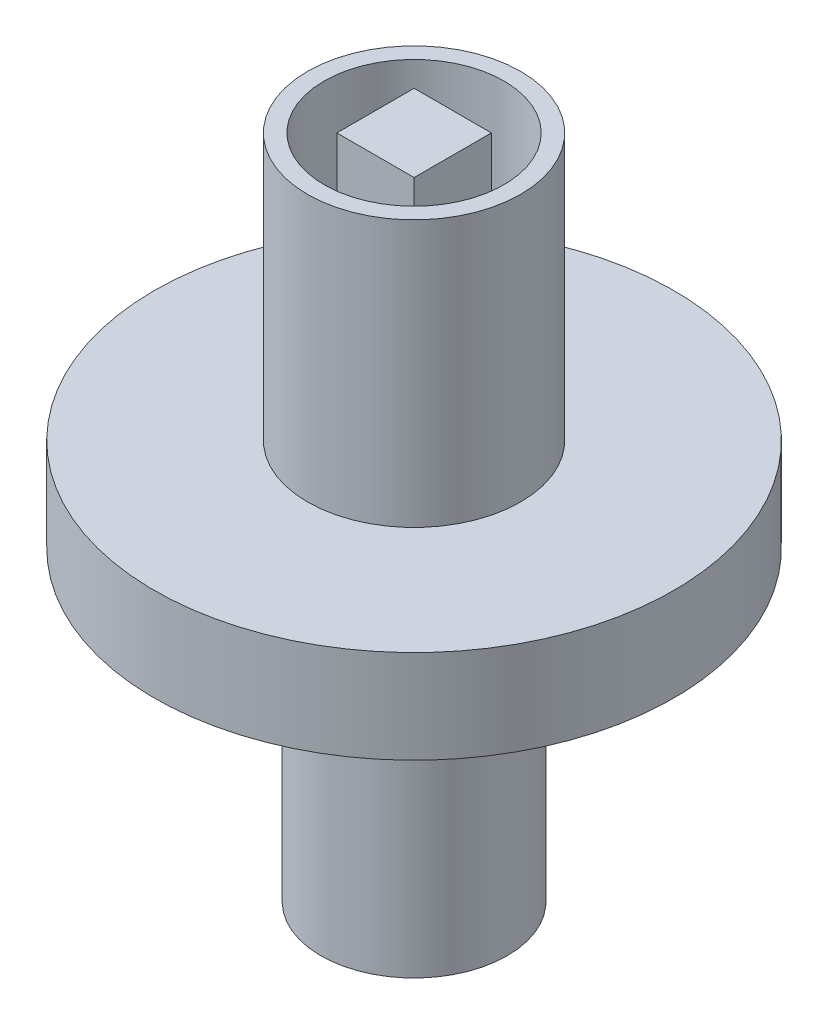
ISO-10303-21;
HEADER;
FILE_DESCRIPTION(('STEP AP214'),'2;1');
FILE_NAME('part.step','',(''),(''),'','','');
FILE_SCHEMA(('AUTOMOTIVE_DESIGN { 1 0 10303 214 1 1 1 1 }'));
ENDSEC;
DATA;
#1=APPLICATION_CONTEXT('core data for automotive mechanical design processes');
#2=APPLICATION_PROTOCOL_DEFINITION('international standard','automotive_design',2000,#1);
#3=PRODUCT_CONTEXT('',#1,'mechanical');
#4=PRODUCT('Part','Part','',(#3));
#5=PRODUCT_RELATED_PRODUCT_CATEGORY('part','',(#4));
#6=PRODUCT_DEFINITION_FORMATION('','',#4);
#7=PRODUCT_DEFINITION_CONTEXT('part definition',#1,'design');
#8=PRODUCT_DEFINITION('design','',#6,#7);
#9=PRODUCT_DEFINITION_SHAPE('','',#8);
#10=(LENGTH_UNIT() NAMED_UNIT(*) SI_UNIT(.MILLI.,.METRE.));
#11=(NAMED_UNIT(*) PLANE_ANGLE_UNIT() SI_UNIT($,.RADIAN.));
#12=(NAMED_UNIT(*) SI_UNIT($,.STERADIAN.) SOLID_ANGLE_UNIT());
#13=UNCERTAINTY_MEASURE_WITH_UNIT(LENGTH_MEASURE(1.E-05),#10,'distance_accuracy_value','');
#14=(GEOMETRIC_REPRESENTATION_CONTEXT(3) GLOBAL_UNCERTAINTY_ASSIGNED_CONTEXT((#13)) GLOBAL_UNIT_ASSIGNED_CONTEXT((#10,
#11,#12)) REPRESENTATION_CONTEXT('',''));
#15=CARTESIAN_POINT('',(0.,0.,0.));
#16=DIRECTION('',(0.,0.,1.));
#17=DIRECTION('',(1.,0.,0.));
#18=AXIS2_PLACEMENT_3D('',#15,#16,#17);
#19=CARTESIAN_POINT('',(0.,-8.,0.));
#20=DIRECTION('',(0.,-1.,0.));
#21=DIRECTION('',(1.,0.,0.));
#22=AXIS2_PLACEMENT_3D('',#19,#20,#21);
#23=CYLINDRICAL_SURFACE('',#22,3.5);
#24=CARTESIAN_POINT('',(0.,-8.,0.));
#25=DIRECTION('',(0.,-1.,0.));
#26=DIRECTION('',(1.,0.,0.));
#27=AXIS2_PLACEMENT_3D('',#24,#25,#26);
#28=CIRCLE('',#27,3.5);
#29=CARTESIAN_POINT('',(-1.49999999999997,-8.00000000000001,3.16227766016838));
#30=VERTEX_POINT('',#29);
#31=CARTESIAN_POINT('',(-3.16227766016835,-8.00000000000001,1.5));
#32=VERTEX_POINT('',#31);
#33=EDGE_CURVE('E191',#30,#32,#28,.T.);
#34=ORIENTED_EDGE('',*,*,#33,.F.);
#35=DIRECTION('',(0.,-1.,0.));
#36=VECTOR('',#35,1.);
#37=CARTESIAN_POINT('',(-1.49999999999997,-8.00000000000001,3.16227766016838));
#38=LINE('',#37,#36);
#39=CARTESIAN_POINT('',(-1.49999999999992,-23.,3.16227766016838));
#40=VERTEX_POINT('',#39);
#41=EDGE_CURVE('E290',#30,#40,#38,.T.);
#42=ORIENTED_EDGE('',*,*,#41,.T.);
#43=CARTESIAN_POINT('',(0.,-23.,0.));
#44=DIRECTION('',(0.,-1.,0.));
#45=DIRECTION('',(1.,0.,0.));
#46=AXIS2_PLACEMENT_3D('',#43,#44,#45);
#47=CIRCLE('',#46,3.5);
#48=CARTESIAN_POINT('',(-3.1622776601683,-23.,1.5));
#49=VERTEX_POINT('',#48);
#50=EDGE_CURVE('E301',#40,#49,#47,.T.);
#51=ORIENTED_EDGE('',*,*,#50,.T.);
#52=DIRECTION('',(0.,-1.,0.));
#53=VECTOR('',#52,1.);
#54=CARTESIAN_POINT('',(-3.16227766016835,-8.00000000000001,1.5));
#55=LINE('',#54,#53);
#56=EDGE_CURVE('E256',#49,#32,#55,.F.);
#57=ORIENTED_EDGE('',*,*,#56,.T.);
#58=EDGE_LOOP('',(#34,#42,#51,#57));
#59=FACE_BOUND('',#58,.T.);
#60=ADVANCED_FACE('F43',(#59),#23,.F.);
#61=CARTESIAN_POINT('',(3.16227766016846,-23.,1.5));
#62=VERTEX_POINT('',#61);
#63=CARTESIAN_POINT('',(1.50000000000008,-23.,3.16227766016838));
#64=VERTEX_POINT('',#63);
#65=EDGE_CURVE('E298',#62,#64,#47,.T.);
#66=ORIENTED_EDGE('',*,*,#65,.T.);
#67=DIRECTION('',(0.,-1.,0.));
#68=VECTOR('',#67,1.);
#69=CARTESIAN_POINT('',(1.50000000000003,-7.99999999999999,3.16227766016838));
#70=LINE('',#69,#68);
#71=CARTESIAN_POINT('',(1.50000000000003,-8.,3.16227766016838));
#72=VERTEX_POINT('',#71);
#73=EDGE_CURVE('E287',#64,#72,#70,.F.);
#74=ORIENTED_EDGE('',*,*,#73,.T.);
#75=CARTESIAN_POINT('',(3.16227766016841,-7.99999999999999,1.5));
#76=VERTEX_POINT('',#75);
#77=EDGE_CURVE('E294',#76,#72,#28,.T.);
#78=ORIENTED_EDGE('',*,*,#77,.F.);
#79=DIRECTION('',(0.,-1.,0.));
#80=VECTOR('',#79,1.);
#81=CARTESIAN_POINT('',(3.16227766016841,-7.99999999999999,1.5));
#82=LINE('',#81,#80);
#83=EDGE_CURVE('E284',#76,#62,#82,.T.);
#84=ORIENTED_EDGE('',*,*,#83,.T.);
#85=EDGE_LOOP('',(#66,#74,#78,#84));
#86=FACE_BOUND('',#85,.T.);
#87=ADVANCED_FACE('F376',(#86),#23,.F.);
#88=CARTESIAN_POINT('',(1.50000000000008,-23.,-3.16227766016838));
#89=VERTEX_POINT('',#88);
#90=CARTESIAN_POINT('',(3.16227766016846,-23.,-1.5));
#91=VERTEX_POINT('',#90);
#92=EDGE_CURVE('E293',#89,#91,#47,.T.);
#93=ORIENTED_EDGE('',*,*,#92,.T.);
#94=DIRECTION('',(0.,-1.,0.));
#95=VECTOR('',#94,1.);
#96=CARTESIAN_POINT('',(3.16227766016841,-7.99999999999999,-1.5));
#97=LINE('',#96,#95);
#98=CARTESIAN_POINT('',(3.16227766016841,-7.99999999999999,-1.5));
#99=VERTEX_POINT('',#98);
#100=EDGE_CURVE('E281',#91,#99,#97,.F.);
#101=ORIENTED_EDGE('',*,*,#100,.T.);
#102=CARTESIAN_POINT('',(1.50000000000003,-7.99999999999999,-3.16227766016838));
#103=VERTEX_POINT('',#102);
#104=EDGE_CURVE('E297',#103,#99,#28,.T.);
#105=ORIENTED_EDGE('',*,*,#104,.F.);
#106=DIRECTION('',(0.,-1.,0.));
#107=VECTOR('',#106,1.);
#108=CARTESIAN_POINT('',(1.50000000000003,-7.99999999999999,-3.16227766016838));
#109=LINE('',#108,#107);
#110=EDGE_CURVE('E278',#103,#89,#109,.T.);
#111=ORIENTED_EDGE('',*,*,#110,.T.);
#112=EDGE_LOOP('',(#93,#101,#105,#111));
#113=FACE_BOUND('',#112,.T.);
#114=ADVANCED_FACE('F371',(#113),#23,.F.);
#115=CARTESIAN_POINT('',(0.,12.,0.));
#116=DIRECTION('',(0.,1.,0.));
#117=DIRECTION('',(-1.,0.,0.));
#118=AXIS2_PLACEMENT_3D('',#115,#116,#117);
#119=PLANE('',#118);
#120=CARTESIAN_POINT('',(0.,12.,0.));
#121=DIRECTION('',(0.,1.,0.));
#122=DIRECTION('',(-1.,0.,0.));
#123=AXIS2_PLACEMENT_3D('',#120,#121,#122);
#124=CIRCLE('',#123,6.75);
#125=CARTESIAN_POINT('',(-6.75000000000004,12.,0.));
#126=VERTEX_POINT('',#125);
#127=EDGE_CURVE('E340',#126,#126,#124,.T.);
#128=ORIENTED_EDGE('',*,*,#127,.T.);
#129=EDGE_LOOP('',(#128));
#130=FACE_BOUND('',#129,.T.);
#131=DIRECTION('',(1.,0.,0.));
#132=VECTOR('',#131,1.);
#133=CARTESIAN_POINT('',(-2.89523813184805,12.,2.90262546082187));
#134=LINE('',#133,#132);
#135=CARTESIAN_POINT('',(-2.89523813184805,12.,2.90262546082187));
#136=VERTEX_POINT('',#135);
#137=CARTESIAN_POINT('',(2.90476186815195,12.,2.90262546082187));
#138=VERTEX_POINT('',#137);
#139=EDGE_CURVE('E321',#136,#138,#134,.T.);
#140=ORIENTED_EDGE('',*,*,#139,.F.);
#141=DIRECTION('',(0.,0.,1.));
#142=VECTOR('',#141,1.);
#143=CARTESIAN_POINT('',(-2.89523813184805,12.,-2.89737453917813));
#144=LINE('',#143,#142);
#145=CARTESIAN_POINT('',(-2.89523813184805,12.,-2.89737453917813));
#146=VERTEX_POINT('',#145);
#147=EDGE_CURVE('E303',#146,#136,#144,.T.);
#148=ORIENTED_EDGE('',*,*,#147,.F.);
#149=DIRECTION('',(-1.,0.,0.));
#150=VECTOR('',#149,1.);
#151=CARTESIAN_POINT('',(-2.89523813184805,12.,-2.89737453917813));
#152=LINE('',#151,#150);
#153=CARTESIAN_POINT('',(2.90476186815195,12.,-2.89737453917813));
#154=VERTEX_POINT('',#153);
#155=EDGE_CURVE('E310',#154,#146,#152,.T.);
#156=ORIENTED_EDGE('',*,*,#155,.F.);
#157=DIRECTION('',(0.,0.,-1.));
#158=VECTOR('',#157,1.);
#159=CARTESIAN_POINT('',(2.90476186815195,12.,-2.89737453917813));
#160=LINE('',#159,#158);
#161=EDGE_CURVE('E323',#138,#154,#160,.T.);
#162=ORIENTED_EDGE('',*,*,#161,.F.);
#163=EDGE_LOOP('',(#140,#148,#156,#162));
#164=FACE_BOUND('',#163,.T.);
#165=ADVANCED_FACE('F363',(#130,#164),#119,.T.);
#166=CARTESIAN_POINT('',(0.,0.,0.));
#167=DIRECTION('',(0.,1.,0.));
#168=DIRECTION('',(-1.,0.,0.));
#169=AXIS2_PLACEMENT_3D('',#166,#167,#168);
#170=PLANE('',#169);
#171=CARTESIAN_POINT('',(0.,0.,0.));
#172=DIRECTION('',(0.,-1.,0.));
#173=DIRECTION('',(1.,0.,0.));
#174=AXIS2_PLACEMENT_3D('',#171,#172,#173);
#175=CIRCLE('',#174,7.);
#176=CARTESIAN_POINT('',(7.,0.,0.));
#177=VERTEX_POINT('',#176);
#178=EDGE_CURVE('E11',#177,#177,#175,.T.);
#179=ORIENTED_EDGE('',*,*,#178,.F.);
#180=EDGE_LOOP('',(#179));
#181=FACE_BOUND('',#180,.T.);
#182=CARTESIAN_POINT('',(3.30263446518398E-13,0.,0.));
#183=DIRECTION('',(0.,1.,0.));
#184=DIRECTION('',(-1.,0.,0.));
#185=AXIS2_PLACEMENT_3D('',#182,#183,#184);
#186=CIRCLE('',#185,19.4999999999997);
#187=CARTESIAN_POINT('',(-19.4999999999993,-1.36278794517344E-13,0.));
#188=VERTEX_POINT('',#187);
#189=EDGE_CURVE('E47',#188,#188,#186,.T.);
#190=ORIENTED_EDGE('',*,*,#189,.F.);
#191=EDGE_LOOP('',(#190));
#192=FACE_BOUND('',#191,.T.);
#193=ADVANCED_FACE('F45',(#181,#192),#170,.F.);
#194=CARTESIAN_POINT('',(0.,96.2797297297297,0.));
#195=DIRECTION('',(0.,1.,0.));
#196=DIRECTION('',(-1.,0.,0.));
#197=AXIS2_PLACEMENT_3D('',#194,#195,#196);
#198=CYLINDRICAL_SURFACE('',#197,19.4999999999997);
#199=CARTESIAN_POINT('',(3.06251703526197E-13,6.99999999999994,0.));
#200=DIRECTION('',(0.,1.,0.));
#201=DIRECTION('',(-1.,0.,0.));
#202=AXIS2_PLACEMENT_3D('',#199,#200,#201);
#203=CIRCLE('',#202,19.4999999999997);
#204=CARTESIAN_POINT('',(-19.4999999999994,6.99999999999987,0.));
#205=VERTEX_POINT('',#204);
#206=EDGE_CURVE('E352',#205,#205,#203,.T.);
#207=ORIENTED_EDGE('',*,*,#206,.F.);
#208=EDGE_LOOP('',(#207));
#209=FACE_BOUND('',#208,.T.);
#210=ORIENTED_EDGE('',*,*,#189,.T.);
#211=EDGE_LOOP('',(#210));
#212=FACE_BOUND('',#211,.T.);
#213=ADVANCED_FACE('F360',(#209,#212),#198,.T.);
#214=CARTESIAN_POINT('',(19.5,7.00000000000002,0.));
#215=DIRECTION('',(0.,-1.,0.));
#216=DIRECTION('',(1.,0.,0.));
#217=AXIS2_PLACEMENT_3D('',#214,#215,#216);
#218=PLANE('',#217);
#219=CARTESIAN_POINT('',(3.06251703526197E-13,6.99999999999998,0.));
#220=DIRECTION('',(0.,1.,0.));
#221=DIRECTION('',(-1.,0.,0.));
#222=AXIS2_PLACEMENT_3D('',#219,#220,#221);
#223=CIRCLE('',#222,7.99999999999969);
#224=CARTESIAN_POINT('',(-7.99999999999939,6.99999999999995,0.));
#225=VERTEX_POINT('',#224);
#226=EDGE_CURVE('E350',#225,#225,#223,.T.);
#227=ORIENTED_EDGE('',*,*,#226,.F.);
#228=EDGE_LOOP('',(#227));
#229=FACE_BOUND('',#228,.T.);
#230=ORIENTED_EDGE('',*,*,#206,.T.);
#231=EDGE_LOOP('',(#230));
#232=FACE_BOUND('',#231,.T.);
#233=ADVANCED_FACE('F369',(#229,#232),#218,.F.);
#234=CARTESIAN_POINT('',(0.,96.2797297297297,0.));
#235=DIRECTION('',(0.,1.,0.));
#236=DIRECTION('',(-1.,0.,0.));
#237=AXIS2_PLACEMENT_3D('',#234,#235,#236);
#238=CYLINDRICAL_SURFACE('',#237,7.99999999999973);
#239=CARTESIAN_POINT('',(2.37646723548482E-13,27.,0.));
#240=DIRECTION('',(0.,1.,0.));
#241=DIRECTION('',(-1.,0.,0.));
#242=AXIS2_PLACEMENT_3D('',#239,#240,#241);
#243=CIRCLE('',#242,7.99999999999976);
#244=CARTESIAN_POINT('',(-7.99999999999952,26.9999999999999,0.));
#245=VERTEX_POINT('',#244);
#246=EDGE_CURVE('E343',#245,#245,#243,.T.);
#247=ORIENTED_EDGE('',*,*,#246,.F.);
#248=EDGE_LOOP('',(#247));
#249=FACE_BOUND('',#248,.T.);
#250=ORIENTED_EDGE('',*,*,#226,.T.);
#251=EDGE_LOOP('',(#250));
#252=FACE_BOUND('',#251,.T.);
#253=ADVANCED_FACE('F636',(#249,#252),#238,.T.);
#254=CARTESIAN_POINT('',(8.,27.,0.));
#255=DIRECTION('',(0.,-1.,0.));
#256=DIRECTION('',(1.,0.,0.));
#257=AXIS2_PLACEMENT_3D('',#254,#255,#256);
#258=PLANE('',#257);
#259=CARTESIAN_POINT('',(0.,27.,0.));
#260=DIRECTION('',(0.,1.,0.));
#261=DIRECTION('',(-1.,0.,0.));
#262=AXIS2_PLACEMENT_3D('',#259,#260,#261);
#263=CIRCLE('',#262,6.75);
#264=CARTESIAN_POINT('',(-6.75000000000009,27.,0.));
#265=VERTEX_POINT('',#264);
#266=EDGE_CURVE('E339',#265,#265,#263,.T.);
#267=ORIENTED_EDGE('',*,*,#266,.F.);
#268=EDGE_LOOP('',(#267));
#269=FACE_BOUND('',#268,.T.);
#270=ORIENTED_EDGE('',*,*,#246,.T.);
#271=EDGE_LOOP('',(#270));
#272=FACE_BOUND('',#271,.T.);
#273=ADVANCED_FACE('F627',(#269,#272),#258,.F.);
#274=CARTESIAN_POINT('',(0.,12.,0.));
#275=DIRECTION('',(0.,1.,0.));
#276=DIRECTION('',(-1.,0.,0.));
#277=AXIS2_PLACEMENT_3D('',#274,#275,#276);
#278=CYLINDRICAL_SURFACE('',#277,6.75);
#279=ORIENTED_EDGE('',*,*,#127,.F.);
#280=EDGE_LOOP('',(#279));
#281=FACE_BOUND('',#280,.T.);
#282=ORIENTED_EDGE('',*,*,#266,.T.);
#283=EDGE_LOOP('',(#282));
#284=FACE_BOUND('',#283,.T.);
#285=ADVANCED_FACE('F617',(#281,#284),#278,.F.);
#286=CARTESIAN_POINT('',(-2.8952381318481,27.,-2.89737453917813));
#287=DIRECTION('',(1.,0.,0.));
#288=DIRECTION('',(0.,1.,0.));
#289=AXIS2_PLACEMENT_3D('',#286,#287,#288);
#290=PLANE('',#289);
#291=ORIENTED_EDGE('',*,*,#147,.T.);
#292=DIRECTION('',(0.,-1.,0.));
#293=VECTOR('',#292,1.);
#294=CARTESIAN_POINT('',(-2.8952381318481,27.,2.90262546082187));
#295=LINE('',#294,#293);
#296=CARTESIAN_POINT('',(-2.8952381318481,27.,2.90262546082187));
#297=VERTEX_POINT('',#296);
#298=EDGE_CURVE('E336',#297,#136,#295,.T.);
#299=ORIENTED_EDGE('',*,*,#298,.F.);
#300=DIRECTION('',(0.,0.,1.));
#301=VECTOR('',#300,1.);
#302=CARTESIAN_POINT('',(-2.8952381318481,27.,-2.89737453917813));
#303=LINE('',#302,#301);
#304=CARTESIAN_POINT('',(-2.8952381318481,27.,-2.89737453917813));
#305=VERTEX_POINT('',#304);
#306=EDGE_CURVE('E305',#305,#297,#303,.T.);
#307=ORIENTED_EDGE('',*,*,#306,.F.);
#308=DIRECTION('',(0.,-1.,0.));
#309=VECTOR('',#308,1.);
#310=CARTESIAN_POINT('',(-2.8952381318481,27.,-2.89737453917813));
#311=LINE('',#310,#309);
#312=EDGE_CURVE('E318',#305,#146,#311,.T.);
#313=ORIENTED_EDGE('',*,*,#312,.T.);
#314=EDGE_LOOP('',(#291,#299,#307,#313));
#315=FACE_BOUND('',#314,.T.);
#316=ADVANCED_FACE('F608',(#315),#290,.F.);
#317=CARTESIAN_POINT('',(-2.8952381318481,27.,2.90262546082187));
#318=DIRECTION('',(0.,0.,-1.));
#319=DIRECTION('',(-1.,0.,0.));
#320=AXIS2_PLACEMENT_3D('',#317,#318,#319);
#321=PLANE('',#320);
#322=ORIENTED_EDGE('',*,*,#139,.T.);
#323=DIRECTION('',(0.,-1.,0.));
#324=VECTOR('',#323,1.);
#325=CARTESIAN_POINT('',(2.9047618681519,27.,2.90262546082187));
#326=LINE('',#325,#324);
#327=CARTESIAN_POINT('',(2.9047618681519,27.,2.90262546082187));
#328=VERTEX_POINT('',#327);
#329=EDGE_CURVE('E332',#328,#138,#326,.T.);
#330=ORIENTED_EDGE('',*,*,#329,.F.);
#331=DIRECTION('',(1.,0.,0.));
#332=VECTOR('',#331,1.);
#333=CARTESIAN_POINT('',(-2.8952381318481,27.,2.90262546082187));
#334=LINE('',#333,#332);
#335=EDGE_CURVE('E309',#297,#328,#334,.T.);
#336=ORIENTED_EDGE('',*,*,#335,.F.);
#337=ORIENTED_EDGE('',*,*,#298,.T.);
#338=EDGE_LOOP('',(#322,#330,#336,#337));
#339=FACE_BOUND('',#338,.T.);
#340=ADVANCED_FACE('F599',(#339),#321,.F.);
#341=CARTESIAN_POINT('',(2.9047618681519,27.,-2.89737453917813));
#342=DIRECTION('',(-1.,0.,0.));
#343=DIRECTION('',(0.,-1.,0.));
#344=AXIS2_PLACEMENT_3D('',#341,#342,#343);
#345=PLANE('',#344);
#346=ORIENTED_EDGE('',*,*,#161,.T.);
#347=DIRECTION('',(0.,-1.,0.));
#348=VECTOR('',#347,1.);
#349=CARTESIAN_POINT('',(2.9047618681519,27.,-2.89737453917813));
#350=LINE('',#349,#348);
#351=CARTESIAN_POINT('',(2.9047618681519,27.,-2.89737453917813));
#352=VERTEX_POINT('',#351);
#353=EDGE_CURVE('E330',#352,#154,#350,.T.);
#354=ORIENTED_EDGE('',*,*,#353,.F.);
#355=DIRECTION('',(0.,0.,-1.));
#356=VECTOR('',#355,1.);
#357=CARTESIAN_POINT('',(2.9047618681519,27.,-2.89737453917813));
#358=LINE('',#357,#356);
#359=EDGE_CURVE('E313',#328,#352,#358,.T.);
#360=ORIENTED_EDGE('',*,*,#359,.F.);
#361=ORIENTED_EDGE('',*,*,#329,.T.);
#362=EDGE_LOOP('',(#346,#354,#360,#361));
#363=FACE_BOUND('',#362,.T.);
#364=ADVANCED_FACE('F591',(#363),#345,.F.);
#365=CARTESIAN_POINT('',(-2.8952381318481,27.,-2.89737453917813));
#366=DIRECTION('',(0.,0.,1.));
#367=DIRECTION('',(1.,0.,0.));
#368=AXIS2_PLACEMENT_3D('',#365,#366,#367);
#369=PLANE('',#368);
#370=ORIENTED_EDGE('',*,*,#155,.T.);
#371=ORIENTED_EDGE('',*,*,#312,.F.);
#372=DIRECTION('',(-1.,0.,0.));
#373=VECTOR('',#372,1.);
#374=CARTESIAN_POINT('',(-2.8952381318481,27.,-2.89737453917813));
#375=LINE('',#374,#373);
#376=EDGE_CURVE('E316',#352,#305,#375,.T.);
#377=ORIENTED_EDGE('',*,*,#376,.F.);
#378=ORIENTED_EDGE('',*,*,#353,.T.);
#379=EDGE_LOOP('',(#370,#371,#377,#378));
#380=FACE_BOUND('',#379,.T.);
#381=ADVANCED_FACE('F583',(#380),#369,.F.);
#382=CARTESIAN_POINT('',(0.,27.,0.));
#383=DIRECTION('',(0.,1.,0.));
#384=DIRECTION('',(-1.,0.,0.));
#385=AXIS2_PLACEMENT_3D('',#382,#383,#384);
#386=PLANE('',#385);
#387=ORIENTED_EDGE('',*,*,#306,.T.);
#388=ORIENTED_EDGE('',*,*,#335,.T.);
#389=ORIENTED_EDGE('',*,*,#359,.T.);
#390=ORIENTED_EDGE('',*,*,#376,.T.);
#391=EDGE_LOOP('',(#387,#388,#389,#390));
#392=FACE_BOUND('',#391,.T.);
#393=ADVANCED_FACE('F576',(#392),#386,.T.);
#394=CARTESIAN_POINT('',(0.,-23.,0.));
#395=DIRECTION('',(0.,1.,0.));
#396=DIRECTION('',(-1.,0.,0.));
#397=AXIS2_PLACEMENT_3D('',#394,#395,#396);
#398=CYLINDRICAL_SURFACE('',#397,7.);
#399=CARTESIAN_POINT('',(0.,-23.,0.));
#400=DIRECTION('',(0.,-1.,0.));
#401=DIRECTION('',(1.,0.,0.));
#402=AXIS2_PLACEMENT_3D('',#399,#400,#401);
#403=CIRCLE('',#402,7.);
#404=CARTESIAN_POINT('',(7.00000000000008,-23.,0.));
#405=VERTEX_POINT('',#404);
#406=EDGE_CURVE('E296',#405,#405,#403,.T.);
#407=ORIENTED_EDGE('',*,*,#406,.F.);
#408=EDGE_LOOP('',(#407));
#409=FACE_BOUND('',#408,.T.);
#410=ORIENTED_EDGE('',*,*,#178,.T.);
#411=EDGE_LOOP('',(#410));
#412=FACE_BOUND('',#411,.T.);
#413=ADVANCED_FACE('F393',(#409,#412),#398,.T.);
#414=CARTESIAN_POINT('',(0.,-23.,0.));
#415=DIRECTION('',(0.,-1.,0.));
#416=DIRECTION('',(1.,0.,0.));
#417=AXIS2_PLACEMENT_3D('',#414,#415,#416);
#418=PLANE('',#417);
#419=DIRECTION('',(0.,0.,-1.));
#420=VECTOR('',#419,1.);
#421=CARTESIAN_POINT('',(-1.49999999999992,-23.,1.5));
#422=LINE('',#421,#420);
#423=CARTESIAN_POINT('',(-1.49999999999992,-23.,5.3));
#424=VERTEX_POINT('',#423);
#425=EDGE_CURVE('E228',#424,#40,#422,.T.);
#426=ORIENTED_EDGE('',*,*,#425,.F.);
#427=DIRECTION('',(-1.,0.,0.));
#428=VECTOR('',#427,1.);
#429=CARTESIAN_POINT('',(-1.49999999999992,-23.,5.3));
#430=LINE('',#429,#428);
#431=CARTESIAN_POINT('',(1.50000000000008,-23.,5.3));
#432=VERTEX_POINT('',#431);
#433=EDGE_CURVE('E251',#432,#424,#430,.T.);
#434=ORIENTED_EDGE('',*,*,#433,.F.);
#435=DIRECTION('',(0.,0.,1.));
#436=VECTOR('',#435,1.);
#437=CARTESIAN_POINT('',(1.50000000000008,-23.,1.5));
#438=LINE('',#437,#436);
#439=EDGE_CURVE('E249',#64,#432,#438,.T.);
#440=ORIENTED_EDGE('',*,*,#439,.F.);
#441=ORIENTED_EDGE('',*,*,#65,.F.);
#442=DIRECTION('',(-1.,0.,0.));
#443=VECTOR('',#442,1.);
#444=CARTESIAN_POINT('',(1.50000000000008,-23.,1.5));
#445=LINE('',#444,#443);
#446=CARTESIAN_POINT('',(5.30000000000008,-23.,1.5));
#447=VERTEX_POINT('',#446);
#448=EDGE_CURVE('E247',#447,#62,#445,.T.);
#449=ORIENTED_EDGE('',*,*,#448,.F.);
#450=DIRECTION('',(0.,0.,1.));
#451=VECTOR('',#450,1.);
#452=CARTESIAN_POINT('',(5.30000000000008,-23.,1.5));
#453=LINE('',#452,#451);
#454=CARTESIAN_POINT('',(5.30000000000008,-23.,-1.5));
#455=VERTEX_POINT('',#454);
#456=EDGE_CURVE('E244',#455,#447,#453,.T.);
#457=ORIENTED_EDGE('',*,*,#456,.F.);
#458=DIRECTION('',(1.,0.,0.));
#459=VECTOR('',#458,1.);
#460=CARTESIAN_POINT('',(1.50000000000008,-23.,-1.5));
#461=LINE('',#460,#459);
#462=EDGE_CURVE('E242',#91,#455,#461,.T.);
#463=ORIENTED_EDGE('',*,*,#462,.F.);
#464=ORIENTED_EDGE('',*,*,#92,.F.);
#465=DIRECTION('',(0.,0.,1.));
#466=VECTOR('',#465,1.);
#467=CARTESIAN_POINT('',(1.50000000000008,-23.,-5.3));
#468=LINE('',#467,#466);
#469=CARTESIAN_POINT('',(1.50000000000008,-23.,-5.3));
#470=VERTEX_POINT('',#469);
#471=EDGE_CURVE('E240',#470,#89,#468,.T.);
#472=ORIENTED_EDGE('',*,*,#471,.F.);
#473=DIRECTION('',(1.,0.,0.));
#474=VECTOR('',#473,1.);
#475=CARTESIAN_POINT('',(-1.49999999999992,-23.,-5.3));
#476=LINE('',#475,#474);
#477=CARTESIAN_POINT('',(-1.49999999999992,-23.,-5.3));
#478=VERTEX_POINT('',#477);
#479=EDGE_CURVE('E237',#478,#470,#476,.T.);
#480=ORIENTED_EDGE('',*,*,#479,.F.);
#481=DIRECTION('',(0.,0.,-1.));
#482=VECTOR('',#481,1.);
#483=CARTESIAN_POINT('',(-1.49999999999992,-23.,-5.3));
#484=LINE('',#483,#482);
#485=CARTESIAN_POINT('',(-1.49999999999992,-23.,-3.16227766016838));
#486=VERTEX_POINT('',#485);
#487=EDGE_CURVE('E235',#486,#478,#484,.T.);
#488=ORIENTED_EDGE('',*,*,#487,.F.);
#489=CARTESIAN_POINT('',(-3.1622776601683,-23.,-1.5));
#490=VERTEX_POINT('',#489);
#491=EDGE_CURVE('E405',#490,#486,#47,.T.);
#492=ORIENTED_EDGE('',*,*,#491,.F.);
#493=DIRECTION('',(1.,0.,0.));
#494=VECTOR('',#493,1.);
#495=CARTESIAN_POINT('',(-5.29999999999992,-23.,-1.5));
#496=LINE('',#495,#494);
#497=CARTESIAN_POINT('',(-5.29999999999992,-23.,-1.5));
#498=VERTEX_POINT('',#497);
#499=EDGE_CURVE('E233',#498,#490,#496,.T.);
#500=ORIENTED_EDGE('',*,*,#499,.F.);
#501=DIRECTION('',(0.,0.,-1.));
#502=VECTOR('',#501,1.);
#503=CARTESIAN_POINT('',(-5.29999999999992,-23.,1.5));
#504=LINE('',#503,#502);
#505=CARTESIAN_POINT('',(-5.29999999999992,-23.,1.5));
#506=VERTEX_POINT('',#505);
#507=EDGE_CURVE('E231',#506,#498,#504,.T.);
#508=ORIENTED_EDGE('',*,*,#507,.F.);
#509=DIRECTION('',(-1.,0.,0.));
#510=VECTOR('',#509,1.);
#511=CARTESIAN_POINT('',(-5.29999999999992,-23.,1.5));
#512=LINE('',#511,#510);
#513=EDGE_CURVE('E200',#49,#506,#512,.T.);
#514=ORIENTED_EDGE('',*,*,#513,.F.);
#515=ORIENTED_EDGE('',*,*,#50,.F.);
#516=EDGE_LOOP('',(#426,#434,#440,#441,#449,#457,#463,#464,#472,#480,#488,#492,#500,#508,#514,#515));
#517=FACE_BOUND('',#516,.T.);
#518=ORIENTED_EDGE('',*,*,#406,.T.);
#519=EDGE_LOOP('',(#518));
#520=FACE_BOUND('',#519,.T.);
#521=ADVANCED_FACE('F387',(#517,#520),#418,.T.);
#522=ORIENTED_EDGE('',*,*,#491,.T.);
#523=DIRECTION('',(0.,-1.,0.));
#524=VECTOR('',#523,1.);
#525=CARTESIAN_POINT('',(-1.49999999999997,-8.00000000000001,-3.16227766016838));
#526=LINE('',#525,#524);
#527=CARTESIAN_POINT('',(-1.49999999999997,-8.,-3.16227766016838));
#528=VERTEX_POINT('',#527);
#529=EDGE_CURVE('E275',#486,#528,#526,.F.);
#530=ORIENTED_EDGE('',*,*,#529,.T.);
#531=CARTESIAN_POINT('',(-3.16227766016835,-8.00000000000001,-1.5));
#532=VERTEX_POINT('',#531);
#533=EDGE_CURVE('E418',#532,#528,#28,.T.);
#534=ORIENTED_EDGE('',*,*,#533,.F.);
#535=DIRECTION('',(0.,-1.,0.));
#536=VECTOR('',#535,1.);
#537=CARTESIAN_POINT('',(-3.16227766016835,-8.00000000000001,-1.5));
#538=LINE('',#537,#536);
#539=EDGE_CURVE('E272',#532,#490,#538,.T.);
#540=ORIENTED_EDGE('',*,*,#539,.T.);
#541=EDGE_LOOP('',(#522,#530,#534,#540));
#542=FACE_BOUND('',#541,.T.);
#543=ADVANCED_FACE('F379',(#542),#23,.F.);
#544=CARTESIAN_POINT('',(0.,-8.,0.));
#545=DIRECTION('',(0.,-1.,0.));
#546=DIRECTION('',(1.,0.,0.));
#547=AXIS2_PLACEMENT_3D('',#544,#545,#546);
#548=PLANE('',#547);
#549=ORIENTED_EDGE('',*,*,#77,.T.);
#550=DIRECTION('',(0.,0.,1.));
#551=VECTOR('',#550,1.);
#552=CARTESIAN_POINT('',(1.50000000000003,-8.,1.5));
#553=LINE('',#552,#551);
#554=CARTESIAN_POINT('',(1.50000000000003,-8.,5.3));
#555=VERTEX_POINT('',#554);
#556=EDGE_CURVE('E224',#72,#555,#553,.T.);
#557=ORIENTED_EDGE('',*,*,#556,.T.);
#558=DIRECTION('',(-1.,0.,0.));
#559=VECTOR('',#558,1.);
#560=CARTESIAN_POINT('',(-1.49999999999997,-8.,5.3));
#561=LINE('',#560,#559);
#562=CARTESIAN_POINT('',(-1.49999999999997,-8.,5.3));
#563=VERTEX_POINT('',#562);
#564=EDGE_CURVE('E205',#555,#563,#561,.T.);
#565=ORIENTED_EDGE('',*,*,#564,.T.);
#566=DIRECTION('',(0.,0.,-1.));
#567=VECTOR('',#566,1.);
#568=CARTESIAN_POINT('',(-1.49999999999997,-8.,1.5));
#569=LINE('',#568,#567);
#570=EDGE_CURVE('E194',#563,#30,#569,.T.);
#571=ORIENTED_EDGE('',*,*,#570,.T.);
#572=ORIENTED_EDGE('',*,*,#33,.T.);
#573=DIRECTION('',(-1.,0.,0.));
#574=VECTOR('',#573,1.);
#575=CARTESIAN_POINT('',(-5.29999999999997,-8.00000000000002,1.5));
#576=LINE('',#575,#574);
#577=CARTESIAN_POINT('',(-5.29999999999997,-8.00000000000002,1.5));
#578=VERTEX_POINT('',#577);
#579=EDGE_CURVE('E184',#32,#578,#576,.T.);
#580=ORIENTED_EDGE('',*,*,#579,.T.);
#581=DIRECTION('',(0.,0.,-1.));
#582=VECTOR('',#581,1.);
#583=CARTESIAN_POINT('',(-5.29999999999997,-8.00000000000002,1.5));
#584=LINE('',#583,#582);
#585=CARTESIAN_POINT('',(-5.29999999999997,-8.00000000000002,-1.5));
#586=VERTEX_POINT('',#585);
#587=EDGE_CURVE('E189',#578,#586,#584,.T.);
#588=ORIENTED_EDGE('',*,*,#587,.T.);
#589=DIRECTION('',(1.,0.,0.));
#590=VECTOR('',#589,1.);
#591=CARTESIAN_POINT('',(-5.29999999999997,-8.00000000000002,-1.5));
#592=LINE('',#591,#590);
#593=EDGE_CURVE('E66',#586,#532,#592,.T.);
#594=ORIENTED_EDGE('',*,*,#593,.T.);
#595=ORIENTED_EDGE('',*,*,#533,.T.);
#596=DIRECTION('',(0.,0.,-1.));
#597=VECTOR('',#596,1.);
#598=CARTESIAN_POINT('',(-1.49999999999997,-8.,-5.3));
#599=LINE('',#598,#597);
#600=CARTESIAN_POINT('',(-1.49999999999997,-8.,-5.3));
#601=VERTEX_POINT('',#600);
#602=EDGE_CURVE('E209',#528,#601,#599,.T.);
#603=ORIENTED_EDGE('',*,*,#602,.T.);
#604=DIRECTION('',(1.,0.,0.));
#605=VECTOR('',#604,1.);
#606=CARTESIAN_POINT('',(-1.49999999999997,-8.,-5.3));
#607=LINE('',#606,#605);
#608=CARTESIAN_POINT('',(1.50000000000003,-8.,-5.3));
#609=VERTEX_POINT('',#608);
#610=EDGE_CURVE('E214',#601,#609,#607,.T.);
#611=ORIENTED_EDGE('',*,*,#610,.T.);
#612=DIRECTION('',(0.,0.,1.));
#613=VECTOR('',#612,1.);
#614=CARTESIAN_POINT('',(1.50000000000003,-8.,-5.3));
#615=LINE('',#614,#613);
#616=EDGE_CURVE('E59',#609,#103,#615,.T.);
#617=ORIENTED_EDGE('',*,*,#616,.T.);
#618=ORIENTED_EDGE('',*,*,#104,.T.);
#619=DIRECTION('',(1.,0.,0.));
#620=VECTOR('',#619,1.);
#621=CARTESIAN_POINT('',(1.50000000000003,-8.,-1.5));
#622=LINE('',#621,#620);
#623=CARTESIAN_POINT('',(5.30000000000003,-7.99999999999998,-1.5));
#624=VERTEX_POINT('',#623);
#625=EDGE_CURVE('E217',#99,#624,#622,.T.);
#626=ORIENTED_EDGE('',*,*,#625,.T.);
#627=DIRECTION('',(0.,0.,1.));
#628=VECTOR('',#627,1.);
#629=CARTESIAN_POINT('',(5.30000000000003,-7.99999999999998,1.5));
#630=LINE('',#629,#628);
#631=CARTESIAN_POINT('',(5.30000000000003,-7.99999999999998,1.5));
#632=VERTEX_POINT('',#631);
#633=EDGE_CURVE('E219',#624,#632,#630,.T.);
#634=ORIENTED_EDGE('',*,*,#633,.T.);
#635=DIRECTION('',(-1.,0.,0.));
#636=VECTOR('',#635,1.);
#637=CARTESIAN_POINT('',(1.50000000000003,-8.,1.5));
#638=LINE('',#637,#636);
#639=EDGE_CURVE('E222',#632,#76,#638,.T.);
#640=ORIENTED_EDGE('',*,*,#639,.T.);
#641=EDGE_LOOP('',(#549,#557,#565,#571,#572,#580,#588,#594,#595,#603,#611,#617,#618,#626,#634,#640));
#642=FACE_BOUND('',#641,.T.);
#643=ADVANCED_FACE('F187',(#642),#548,.T.);
#644=CARTESIAN_POINT('',(-5.29999999999997,-8.00000000000002,1.5));
#645=DIRECTION('',(0.,0.,1.));
#646=DIRECTION('',(1.,0.,0.));
#647=AXIS2_PLACEMENT_3D('',#644,#645,#646);
#648=PLANE('',#647);
#649=ORIENTED_EDGE('',*,*,#513,.T.);
#650=DIRECTION('',(0.,-1.,0.));
#651=VECTOR('',#650,1.);
#652=CARTESIAN_POINT('',(-5.29999999999997,-8.00000000000002,1.5));
#653=LINE('',#652,#651);
#654=EDGE_CURVE('E197',#578,#506,#653,.T.);
#655=ORIENTED_EDGE('',*,*,#654,.F.);
#656=ORIENTED_EDGE('',*,*,#579,.F.);
#657=ORIENTED_EDGE('',*,*,#56,.F.);
#658=EDGE_LOOP('',(#649,#655,#656,#657));
#659=FACE_BOUND('',#658,.T.);
#660=ADVANCED_FACE('F198',(#659),#648,.F.);
#661=CARTESIAN_POINT('',(-5.29999999999997,-8.00000000000002,-1.5));
#662=DIRECTION('',(0.,0.,-1.));
#663=DIRECTION('',(-1.,0.,0.));
#664=AXIS2_PLACEMENT_3D('',#661,#662,#663);
#665=PLANE('',#664);
#666=ORIENTED_EDGE('',*,*,#593,.F.);
#667=DIRECTION('',(0.,-1.,0.));
#668=VECTOR('',#667,1.);
#669=CARTESIAN_POINT('',(-5.29999999999997,-8.00000000000002,-1.5));
#670=LINE('',#669,#668);
#671=EDGE_CURVE('E204',#586,#498,#670,.T.);
#672=ORIENTED_EDGE('',*,*,#671,.T.);
#673=ORIENTED_EDGE('',*,*,#499,.T.);
#674=ORIENTED_EDGE('',*,*,#539,.F.);
#675=EDGE_LOOP('',(#666,#672,#673,#674));
#676=FACE_BOUND('',#675,.T.);
#677=ADVANCED_FACE('F416',(#676),#665,.F.);
#678=CARTESIAN_POINT('',(-5.29999999999997,-8.00000000000002,1.5));
#679=DIRECTION('',(-1.,0.,0.));
#680=DIRECTION('',(0.,-1.,0.));
#681=AXIS2_PLACEMENT_3D('',#678,#679,#680);
#682=PLANE('',#681);
#683=ORIENTED_EDGE('',*,*,#507,.T.);
#684=ORIENTED_EDGE('',*,*,#671,.F.);
#685=ORIENTED_EDGE('',*,*,#587,.F.);
#686=ORIENTED_EDGE('',*,*,#654,.T.);
#687=EDGE_LOOP('',(#683,#684,#685,#686));
#688=FACE_BOUND('',#687,.T.);
#689=ADVANCED_FACE('F207',(#688),#682,.F.);
#690=CARTESIAN_POINT('',(1.50000000000003,-8.,1.5));
#691=DIRECTION('',(1.,0.,0.));
#692=DIRECTION('',(0.,1.,0.));
#693=AXIS2_PLACEMENT_3D('',#690,#691,#692);
#694=PLANE('',#693);
#695=ORIENTED_EDGE('',*,*,#439,.T.);
#696=DIRECTION('',(0.,-1.,0.));
#697=VECTOR('',#696,1.);
#698=CARTESIAN_POINT('',(1.50000000000003,-8.,5.3));
#699=LINE('',#698,#697);
#700=EDGE_CURVE('E257',#555,#432,#699,.T.);
#701=ORIENTED_EDGE('',*,*,#700,.F.);
#702=ORIENTED_EDGE('',*,*,#556,.F.);
#703=ORIENTED_EDGE('',*,*,#73,.F.);
#704=EDGE_LOOP('',(#695,#701,#702,#703));
#705=FACE_BOUND('',#704,.T.);
#706=ADVANCED_FACE('F436',(#705),#694,.F.);
#707=CARTESIAN_POINT('',(-1.49999999999997,-8.,1.5));
#708=DIRECTION('',(-1.,0.,0.));
#709=DIRECTION('',(0.,-1.,0.));
#710=AXIS2_PLACEMENT_3D('',#707,#708,#709);
#711=PLANE('',#710);
#712=ORIENTED_EDGE('',*,*,#570,.F.);
#713=DIRECTION('',(0.,-1.,0.));
#714=VECTOR('',#713,1.);
#715=CARTESIAN_POINT('',(-1.49999999999997,-8.,5.3));
#716=LINE('',#715,#714);
#717=EDGE_CURVE('E254',#563,#424,#716,.T.);
#718=ORIENTED_EDGE('',*,*,#717,.T.);
#719=ORIENTED_EDGE('',*,*,#425,.T.);
#720=ORIENTED_EDGE('',*,*,#41,.F.);
#721=EDGE_LOOP('',(#712,#718,#719,#720));
#722=FACE_BOUND('',#721,.T.);
#723=ADVANCED_FACE('F442',(#722),#711,.F.);
#724=CARTESIAN_POINT('',(-1.49999999999997,-8.,5.3));
#725=DIRECTION('',(0.,0.,1.));
#726=DIRECTION('',(1.,0.,0.));
#727=AXIS2_PLACEMENT_3D('',#724,#725,#726);
#728=PLANE('',#727);
#729=ORIENTED_EDGE('',*,*,#433,.T.);
#730=ORIENTED_EDGE('',*,*,#717,.F.);
#731=ORIENTED_EDGE('',*,*,#564,.F.);
#732=ORIENTED_EDGE('',*,*,#700,.T.);
#733=EDGE_LOOP('',(#729,#730,#731,#732));
#734=FACE_BOUND('',#733,.T.);
#735=ADVANCED_FACE('F438',(#734),#728,.F.);
#736=CARTESIAN_POINT('',(1.50000000000003,-8.,-1.5));
#737=DIRECTION('',(0.,0.,-1.));
#738=DIRECTION('',(-1.,0.,0.));
#739=AXIS2_PLACEMENT_3D('',#736,#737,#738);
#740=PLANE('',#739);
#741=ORIENTED_EDGE('',*,*,#462,.T.);
#742=DIRECTION('',(0.,-1.,0.));
#743=VECTOR('',#742,1.);
#744=CARTESIAN_POINT('',(5.30000000000003,-7.99999999999998,-1.5));
#745=LINE('',#744,#743);
#746=EDGE_CURVE('E262',#624,#455,#745,.T.);
#747=ORIENTED_EDGE('',*,*,#746,.F.);
#748=ORIENTED_EDGE('',*,*,#625,.F.);
#749=ORIENTED_EDGE('',*,*,#100,.F.);
#750=EDGE_LOOP('',(#741,#747,#748,#749));
#751=FACE_BOUND('',#750,.T.);
#752=ADVANCED_FACE('F422',(#751),#740,.F.);
#753=CARTESIAN_POINT('',(1.50000000000003,-8.,1.5));
#754=DIRECTION('',(0.,0.,1.));
#755=DIRECTION('',(1.,0.,0.));
#756=AXIS2_PLACEMENT_3D('',#753,#754,#755);
#757=PLANE('',#756);
#758=ORIENTED_EDGE('',*,*,#639,.F.);
#759=DIRECTION('',(0.,-1.,0.));
#760=VECTOR('',#759,1.);
#761=CARTESIAN_POINT('',(5.30000000000003,-7.99999999999998,1.5));
#762=LINE('',#761,#760);
#763=EDGE_CURVE('E260',#632,#447,#762,.T.);
#764=ORIENTED_EDGE('',*,*,#763,.T.);
#765=ORIENTED_EDGE('',*,*,#448,.T.);
#766=ORIENTED_EDGE('',*,*,#83,.F.);
#767=EDGE_LOOP('',(#758,#764,#765,#766));
#768=FACE_BOUND('',#767,.T.);
#769=ADVANCED_FACE('F430',(#768),#757,.F.);
#770=CARTESIAN_POINT('',(5.30000000000003,-7.99999999999998,1.5));
#771=DIRECTION('',(1.,0.,0.));
#772=DIRECTION('',(0.,1.,0.));
#773=AXIS2_PLACEMENT_3D('',#770,#771,#772);
#774=PLANE('',#773);
#775=ORIENTED_EDGE('',*,*,#456,.T.);
#776=ORIENTED_EDGE('',*,*,#763,.F.);
#777=ORIENTED_EDGE('',*,*,#633,.F.);
#778=ORIENTED_EDGE('',*,*,#746,.T.);
#779=EDGE_LOOP('',(#775,#776,#777,#778));
#780=FACE_BOUND('',#779,.T.);
#781=ADVANCED_FACE('F425',(#780),#774,.F.);
#782=CARTESIAN_POINT('',(1.50000000000003,-8.,-5.3));
#783=DIRECTION('',(1.,0.,0.));
#784=DIRECTION('',(0.,1.,0.));
#785=AXIS2_PLACEMENT_3D('',#782,#783,#784);
#786=PLANE('',#785);
#787=ORIENTED_EDGE('',*,*,#616,.F.);
#788=DIRECTION('',(0.,-1.,0.));
#789=VECTOR('',#788,1.);
#790=CARTESIAN_POINT('',(1.50000000000003,-8.,-5.3));
#791=LINE('',#790,#789);
#792=EDGE_CURVE('E265',#609,#470,#791,.T.);
#793=ORIENTED_EDGE('',*,*,#792,.T.);
#794=ORIENTED_EDGE('',*,*,#471,.T.);
#795=ORIENTED_EDGE('',*,*,#110,.F.);
#796=EDGE_LOOP('',(#787,#793,#794,#795));
#797=FACE_BOUND('',#796,.T.);
#798=ADVANCED_FACE('F462',(#797),#786,.F.);
#799=CARTESIAN_POINT('',(-1.49999999999997,-8.,-5.3));
#800=DIRECTION('',(-1.,0.,0.));
#801=DIRECTION('',(0.,-1.,0.));
#802=AXIS2_PLACEMENT_3D('',#799,#800,#801);
#803=PLANE('',#802);
#804=ORIENTED_EDGE('',*,*,#487,.T.);
#805=DIRECTION('',(0.,-1.,0.));
#806=VECTOR('',#805,1.);
#807=CARTESIAN_POINT('',(-1.49999999999997,-8.,-5.3));
#808=LINE('',#807,#806);
#809=EDGE_CURVE('E267',#601,#478,#808,.T.);
#810=ORIENTED_EDGE('',*,*,#809,.F.);
#811=ORIENTED_EDGE('',*,*,#602,.F.);
#812=ORIENTED_EDGE('',*,*,#529,.F.);
#813=EDGE_LOOP('',(#804,#810,#811,#812));
#814=FACE_BOUND('',#813,.T.);
#815=ADVANCED_FACE('F458',(#814),#803,.F.);
#816=CARTESIAN_POINT('',(-1.49999999999997,-8.,-5.3));
#817=DIRECTION('',(0.,0.,-1.));
#818=DIRECTION('',(-1.,0.,0.));
#819=AXIS2_PLACEMENT_3D('',#816,#817,#818);
#820=PLANE('',#819);
#821=ORIENTED_EDGE('',*,*,#479,.T.);
#822=ORIENTED_EDGE('',*,*,#792,.F.);
#823=ORIENTED_EDGE('',*,*,#610,.F.);
#824=ORIENTED_EDGE('',*,*,#809,.T.);
#825=EDGE_LOOP('',(#821,#822,#823,#824));
#826=FACE_BOUND('',#825,.T.);
#827=ADVANCED_FACE('F461',(#826),#820,.F.);
#828=CLOSED_SHELL('',(#60,#87,#114,#165,#193,#213,#233,#253,#273,#285,#316,#340,#364,#381,#393,
#413,#521,#543,#643,#660,#677,#689,#706,#723,#735,#752,#769,#781,#798,#815,#827));
#829=MANIFOLD_SOLID_BREP('B2',#828);
#830=ADVANCED_BREP_SHAPE_REPRESENTATION('',(#18,#829),#14);
#831=SHAPE_DEFINITION_REPRESENTATION(#9,#830);
ENDSEC;
END-ISO-10303-21;
